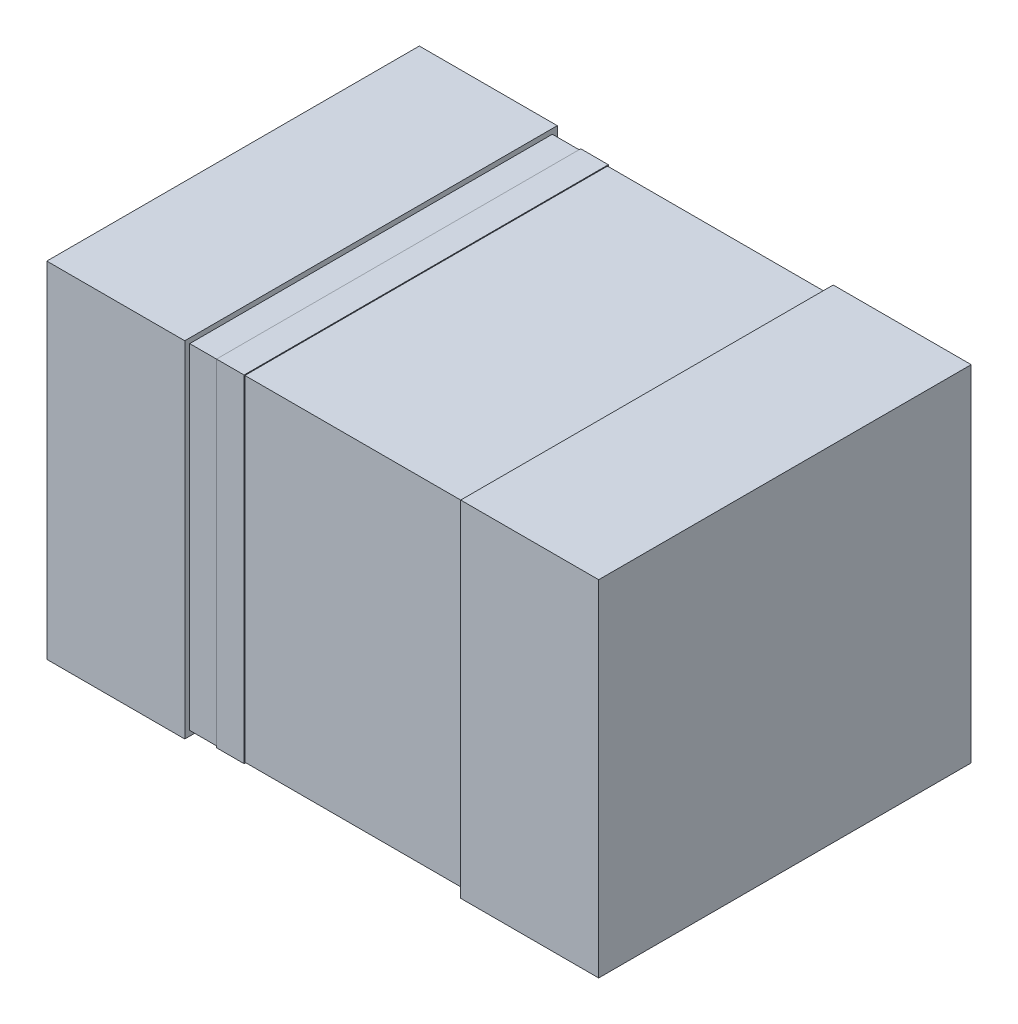
ISO-10303-21;
HEADER;
FILE_DESCRIPTION(('STEP AP214'),'2;1');
FILE_NAME('part.step','',(''),(''),'','','');
FILE_SCHEMA(('AUTOMOTIVE_DESIGN { 1 0 10303 214 1 1 1 1 }'));
ENDSEC;
DATA;
#1=APPLICATION_CONTEXT('core data for automotive mechanical design processes');
#2=APPLICATION_PROTOCOL_DEFINITION('international standard','automotive_design',2000,#1);
#3=PRODUCT_CONTEXT('',#1,'mechanical');
#4=PRODUCT('Part','Part','',(#3));
#5=PRODUCT_RELATED_PRODUCT_CATEGORY('part','',(#4));
#6=PRODUCT_DEFINITION_FORMATION('','',#4);
#7=PRODUCT_DEFINITION_CONTEXT('part definition',#1,'design');
#8=PRODUCT_DEFINITION('design','',#6,#7);
#9=PRODUCT_DEFINITION_SHAPE('','',#8);
#10=(LENGTH_UNIT() NAMED_UNIT(*) SI_UNIT(.MILLI.,.METRE.));
#11=(NAMED_UNIT(*) PLANE_ANGLE_UNIT() SI_UNIT($,.RADIAN.));
#12=(NAMED_UNIT(*) SI_UNIT($,.STERADIAN.) SOLID_ANGLE_UNIT());
#13=UNCERTAINTY_MEASURE_WITH_UNIT(LENGTH_MEASURE(1.E-05),#10,'distance_accuracy_value','');
#14=(GEOMETRIC_REPRESENTATION_CONTEXT(3) GLOBAL_UNCERTAINTY_ASSIGNED_CONTEXT((#13)) GLOBAL_UNIT_ASSIGNED_CONTEXT((#10,
#11,#12)) REPRESENTATION_CONTEXT('',''));
#15=CARTESIAN_POINT('',(0.,0.,0.));
#16=DIRECTION('',(0.,0.,1.));
#17=DIRECTION('',(1.,0.,0.));
#18=AXIS2_PLACEMENT_3D('',#15,#16,#17);
#19=CARTESIAN_POINT('',(-0.5,-0.607,0.018));
#20=DIRECTION('',(0.,-1.,0.));
#21=DIRECTION('',(0.,0.,1.));
#22=AXIS2_PLACEMENT_3D('',#19,#20,#21);
#23=PLANE('',#22);
#24=DIRECTION('',(-1.,0.,0.));
#25=VECTOR('',#24,1.);
#26=CARTESIAN_POINT('',(0.5,-0.607,0.018));
#27=LINE('',#26,#25);
#28=CARTESIAN_POINT('',(0.5,-0.607,0.018));
#29=VERTEX_POINT('',#28);
#30=CARTESIAN_POINT('',(-0.5,-0.607,0.018));
#31=VERTEX_POINT('',#30);
#32=EDGE_CURVE('P0_E11',#29,#31,#27,.T.);
#33=ORIENTED_EDGE('',*,*,#32,.F.);
#34=DIRECTION('',(0.,0.,-1.));
#35=VECTOR('',#34,1.);
#36=CARTESIAN_POINT('',(0.5,-0.607,1.332));
#37=LINE('',#36,#35);
#38=CARTESIAN_POINT('',(0.5,-0.607,1.332));
#39=VERTEX_POINT('',#38);
#40=EDGE_CURVE('P0_E24',#39,#29,#37,.T.);
#41=ORIENTED_EDGE('',*,*,#40,.F.);
#42=DIRECTION('',(1.,0.,0.));
#43=VECTOR('',#42,1.);
#44=CARTESIAN_POINT('',(-0.5,-0.607,1.332));
#45=LINE('',#44,#43);
#46=CARTESIAN_POINT('',(-0.5,-0.607,1.332));
#47=VERTEX_POINT('',#46);
#48=EDGE_CURVE('P0_E88',#47,#39,#45,.T.);
#49=ORIENTED_EDGE('',*,*,#48,.F.);
#50=DIRECTION('',(0.,0.,1.));
#51=VECTOR('',#50,1.);
#52=CARTESIAN_POINT('',(-0.5,-0.607,0.018));
#53=LINE('',#52,#51);
#54=EDGE_CURVE('P0_E77',#31,#47,#53,.T.);
#55=ORIENTED_EDGE('',*,*,#54,.F.);
#56=EDGE_LOOP('',(#33,#41,#49,#55));
#57=FACE_BOUND('',#56,.T.);
#58=ADVANCED_FACE('P0_F17',(#57),#23,.T.);
#59=CARTESIAN_POINT('',(0.5,-0.607,0.018));
#60=DIRECTION('',(1.,0.,0.));
#61=DIRECTION('',(0.,0.,1.));
#62=AXIS2_PLACEMENT_3D('',#59,#60,#61);
#63=PLANE('',#62);
#64=DIRECTION('',(0.,-1.,0.));
#65=VECTOR('',#64,1.);
#66=CARTESIAN_POINT('',(0.5,0.607,0.018));
#67=LINE('',#66,#65);
#68=CARTESIAN_POINT('',(0.5,0.607,0.018));
#69=VERTEX_POINT('',#68);
#70=EDGE_CURVE('P0_E85',#69,#29,#67,.T.);
#71=ORIENTED_EDGE('',*,*,#70,.F.);
#72=DIRECTION('',(0.,0.,-1.));
#73=VECTOR('',#72,1.);
#74=CARTESIAN_POINT('',(0.5,0.607,1.332));
#75=LINE('',#74,#73);
#76=CARTESIAN_POINT('',(0.5,0.607,1.332));
#77=VERTEX_POINT('',#76);
#78=EDGE_CURVE('P0_E83',#77,#69,#75,.T.);
#79=ORIENTED_EDGE('',*,*,#78,.F.);
#80=DIRECTION('',(0.,1.,0.));
#81=VECTOR('',#80,1.);
#82=CARTESIAN_POINT('',(0.5,-0.607,1.332));
#83=LINE('',#82,#81);
#84=EDGE_CURVE('P0_E71',#39,#77,#83,.T.);
#85=ORIENTED_EDGE('',*,*,#84,.F.);
#86=ORIENTED_EDGE('',*,*,#40,.T.);
#87=EDGE_LOOP('',(#71,#79,#85,#86));
#88=FACE_BOUND('',#87,.T.);
#89=ADVANCED_FACE('P0_F90',(#88),#63,.T.);
#90=CARTESIAN_POINT('',(0.5,0.607,0.018));
#91=DIRECTION('',(0.,1.,0.));
#92=DIRECTION('',(0.,0.,1.));
#93=AXIS2_PLACEMENT_3D('',#90,#91,#92);
#94=PLANE('',#93);
#95=DIRECTION('',(1.,0.,0.));
#96=VECTOR('',#95,1.);
#97=CARTESIAN_POINT('',(-0.5,0.607,0.018));
#98=LINE('',#97,#96);
#99=CARTESIAN_POINT('',(-0.5,0.607,0.018));
#100=VERTEX_POINT('',#99);
#101=EDGE_CURVE('P0_E60',#100,#69,#98,.T.);
#102=ORIENTED_EDGE('',*,*,#101,.F.);
#103=DIRECTION('',(0.,0.,-1.));
#104=VECTOR('',#103,1.);
#105=CARTESIAN_POINT('',(-0.5,0.607,1.332));
#106=LINE('',#105,#104);
#107=CARTESIAN_POINT('',(-0.5,0.607,1.332));
#108=VERTEX_POINT('',#107);
#109=EDGE_CURVE('P0_E54',#108,#100,#106,.T.);
#110=ORIENTED_EDGE('',*,*,#109,.F.);
#111=DIRECTION('',(-1.,0.,0.));
#112=VECTOR('',#111,1.);
#113=CARTESIAN_POINT('',(0.5,0.607,1.332));
#114=LINE('',#113,#112);
#115=EDGE_CURVE('P0_E58',#77,#108,#114,.T.);
#116=ORIENTED_EDGE('',*,*,#115,.F.);
#117=ORIENTED_EDGE('',*,*,#78,.T.);
#118=EDGE_LOOP('',(#102,#110,#116,#117));
#119=FACE_BOUND('',#118,.T.);
#120=ADVANCED_FACE('P0_F56',(#119),#94,.T.);
#121=CARTESIAN_POINT('',(-0.5,0.607,0.018));
#122=DIRECTION('',(-1.,0.,0.));
#123=DIRECTION('',(0.,0.,1.));
#124=AXIS2_PLACEMENT_3D('',#121,#122,#123);
#125=PLANE('',#124);
#126=DIRECTION('',(0.,1.,0.));
#127=VECTOR('',#126,1.);
#128=CARTESIAN_POINT('',(-0.5,-0.607,0.018));
#129=LINE('',#128,#127);
#130=EDGE_CURVE('P0_E73',#31,#100,#129,.T.);
#131=ORIENTED_EDGE('',*,*,#130,.F.);
#132=ORIENTED_EDGE('',*,*,#54,.T.);
#133=DIRECTION('',(0.,-1.,0.));
#134=VECTOR('',#133,1.);
#135=CARTESIAN_POINT('',(-0.5,0.607,1.332));
#136=LINE('',#135,#134);
#137=EDGE_CURVE('P0_E69',#108,#47,#136,.T.);
#138=ORIENTED_EDGE('',*,*,#137,.F.);
#139=ORIENTED_EDGE('',*,*,#109,.T.);
#140=EDGE_LOOP('',(#131,#132,#138,#139));
#141=FACE_BOUND('',#140,.T.);
#142=ADVANCED_FACE('P0_F76',(#141),#125,.T.);
#143=CARTESIAN_POINT('',(-0.5,0.607,0.018));
#144=DIRECTION('',(0.,0.,-1.));
#145=DIRECTION('',(0.,1.,0.));
#146=AXIS2_PLACEMENT_3D('',#143,#144,#145);
#147=PLANE('',#146);
#148=ORIENTED_EDGE('',*,*,#101,.T.);
#149=ORIENTED_EDGE('',*,*,#70,.T.);
#150=ORIENTED_EDGE('',*,*,#32,.T.);
#151=ORIENTED_EDGE('',*,*,#130,.T.);
#152=EDGE_LOOP('',(#148,#149,#150,#151));
#153=FACE_BOUND('',#152,.T.);
#154=ADVANCED_FACE('P0_F91',(#153),#147,.T.);
#155=CARTESIAN_POINT('',(-0.5,-0.607,1.332));
#156=DIRECTION('',(0.,0.,1.));
#157=DIRECTION('',(0.,1.,0.));
#158=AXIS2_PLACEMENT_3D('',#155,#156,#157);
#159=PLANE('',#158);
#160=ORIENTED_EDGE('',*,*,#48,.T.);
#161=ORIENTED_EDGE('',*,*,#84,.T.);
#162=ORIENTED_EDGE('',*,*,#115,.T.);
#163=ORIENTED_EDGE('',*,*,#137,.T.);
#164=EDGE_LOOP('',(#160,#161,#162,#163));
#165=FACE_BOUND('',#164,.T.);
#166=ADVANCED_FACE('P0_F68',(#165),#159,.T.);
#167=CLOSED_SHELL('',(#58,#89,#120,#142,#154,#166));
#168=MANIFOLD_SOLID_BREP('P0_B1',#167);
#169=CARTESIAN_POINT('',(0.5,-0.625,0.));
#170=DIRECTION('',(0.,-1.,0.));
#171=DIRECTION('',(0.,0.,1.));
#172=AXIS2_PLACEMENT_3D('',#169,#170,#171);
#173=PLANE('',#172);
#174=DIRECTION('',(-1.,0.,0.));
#175=VECTOR('',#174,1.);
#176=CARTESIAN_POINT('',(1.,-0.625,0.));
#177=LINE('',#176,#175);
#178=CARTESIAN_POINT('',(1.,-0.625,0.));
#179=VERTEX_POINT('',#178);
#180=CARTESIAN_POINT('',(0.5,-0.625,0.));
#181=VERTEX_POINT('',#180);
#182=EDGE_CURVE('P1_E11',#179,#181,#177,.T.);
#183=ORIENTED_EDGE('',*,*,#182,.F.);
#184=DIRECTION('',(0.,0.,-1.));
#185=VECTOR('',#184,1.);
#186=CARTESIAN_POINT('',(1.,-0.625,1.35));
#187=LINE('',#186,#185);
#188=CARTESIAN_POINT('',(1.,-0.625,1.35));
#189=VERTEX_POINT('',#188);
#190=EDGE_CURVE('P1_E24',#189,#179,#187,.T.);
#191=ORIENTED_EDGE('',*,*,#190,.F.);
#192=DIRECTION('',(1.,0.,0.));
#193=VECTOR('',#192,1.);
#194=CARTESIAN_POINT('',(0.5,-0.625,1.35));
#195=LINE('',#194,#193);
#196=CARTESIAN_POINT('',(0.5,-0.625,1.35));
#197=VERTEX_POINT('',#196);
#198=EDGE_CURVE('P1_E87',#197,#189,#195,.T.);
#199=ORIENTED_EDGE('',*,*,#198,.F.);
#200=DIRECTION('',(0.,0.,1.));
#201=VECTOR('',#200,1.);
#202=CARTESIAN_POINT('',(0.5,-0.625,0.));
#203=LINE('',#202,#201);
#204=EDGE_CURVE('P1_E75',#181,#197,#203,.T.);
#205=ORIENTED_EDGE('',*,*,#204,.F.);
#206=EDGE_LOOP('',(#183,#191,#199,#205));
#207=FACE_BOUND('',#206,.T.);
#208=ADVANCED_FACE('P1_F17',(#207),#173,.T.);
#209=CARTESIAN_POINT('',(1.,-0.625,0.));
#210=DIRECTION('',(1.,0.,0.));
#211=DIRECTION('',(0.,0.,1.));
#212=AXIS2_PLACEMENT_3D('',#209,#210,#211);
#213=PLANE('',#212);
#214=DIRECTION('',(0.,-1.,0.));
#215=VECTOR('',#214,1.);
#216=CARTESIAN_POINT('',(1.,0.625,0.));
#217=LINE('',#216,#215);
#218=CARTESIAN_POINT('',(1.,0.625,0.));
#219=VERTEX_POINT('',#218);
#220=EDGE_CURVE('P1_E84',#219,#179,#217,.T.);
#221=ORIENTED_EDGE('',*,*,#220,.F.);
#222=DIRECTION('',(0.,0.,-1.));
#223=VECTOR('',#222,1.);
#224=CARTESIAN_POINT('',(1.,0.625,1.35));
#225=LINE('',#224,#223);
#226=CARTESIAN_POINT('',(1.,0.625,1.35));
#227=VERTEX_POINT('',#226);
#228=EDGE_CURVE('P1_E82',#227,#219,#225,.T.);
#229=ORIENTED_EDGE('',*,*,#228,.F.);
#230=DIRECTION('',(0.,1.,0.));
#231=VECTOR('',#230,1.);
#232=CARTESIAN_POINT('',(1.,-0.625,1.35));
#233=LINE('',#232,#231);
#234=EDGE_CURVE('P1_E60',#189,#227,#233,.T.);
#235=ORIENTED_EDGE('',*,*,#234,.F.);
#236=ORIENTED_EDGE('',*,*,#190,.T.);
#237=EDGE_LOOP('',(#221,#229,#235,#236));
#238=FACE_BOUND('',#237,.T.);
#239=ADVANCED_FACE('P1_F90',(#238),#213,.T.);
#240=CARTESIAN_POINT('',(1.,0.625,0.));
#241=DIRECTION('',(0.,1.,0.));
#242=DIRECTION('',(0.,0.,1.));
#243=AXIS2_PLACEMENT_3D('',#240,#241,#242);
#244=PLANE('',#243);
#245=DIRECTION('',(1.,0.,0.));
#246=VECTOR('',#245,1.);
#247=CARTESIAN_POINT('',(0.5,0.625,0.));
#248=LINE('',#247,#246);
#249=CARTESIAN_POINT('',(0.5,0.625,0.));
#250=VERTEX_POINT('',#249);
#251=EDGE_CURVE('P1_E70',#250,#219,#248,.T.);
#252=ORIENTED_EDGE('',*,*,#251,.F.);
#253=DIRECTION('',(0.,0.,-1.));
#254=VECTOR('',#253,1.);
#255=CARTESIAN_POINT('',(0.5,0.625,1.35));
#256=LINE('',#255,#254);
#257=CARTESIAN_POINT('',(0.5,0.625,1.35));
#258=VERTEX_POINT('',#257);
#259=EDGE_CURVE('P1_E64',#258,#250,#256,.T.);
#260=ORIENTED_EDGE('',*,*,#259,.F.);
#261=DIRECTION('',(-1.,0.,0.));
#262=VECTOR('',#261,1.);
#263=CARTESIAN_POINT('',(1.,0.625,1.35));
#264=LINE('',#263,#262);
#265=EDGE_CURVE('P1_E54',#227,#258,#264,.T.);
#266=ORIENTED_EDGE('',*,*,#265,.F.);
#267=ORIENTED_EDGE('',*,*,#228,.T.);
#268=EDGE_LOOP('',(#252,#260,#266,#267));
#269=FACE_BOUND('',#268,.T.);
#270=ADVANCED_FACE('P1_F68',(#269),#244,.T.);
#271=CARTESIAN_POINT('',(0.5,0.625,0.));
#272=DIRECTION('',(-1.,0.,0.));
#273=DIRECTION('',(0.,0.,1.));
#274=AXIS2_PLACEMENT_3D('',#271,#272,#273);
#275=PLANE('',#274);
#276=DIRECTION('',(0.,1.,0.));
#277=VECTOR('',#276,1.);
#278=CARTESIAN_POINT('',(0.5,-0.625,0.));
#279=LINE('',#278,#277);
#280=EDGE_CURVE('P1_E65',#181,#250,#279,.T.);
#281=ORIENTED_EDGE('',*,*,#280,.F.);
#282=ORIENTED_EDGE('',*,*,#204,.T.);
#283=DIRECTION('',(0.,-1.,0.));
#284=VECTOR('',#283,1.);
#285=CARTESIAN_POINT('',(0.5,0.625,1.35));
#286=LINE('',#285,#284);
#287=EDGE_CURVE('P1_E59',#258,#197,#286,.T.);
#288=ORIENTED_EDGE('',*,*,#287,.F.);
#289=ORIENTED_EDGE('',*,*,#259,.T.);
#290=EDGE_LOOP('',(#281,#282,#288,#289));
#291=FACE_BOUND('',#290,.T.);
#292=ADVANCED_FACE('P1_F74',(#291),#275,.T.);
#293=CARTESIAN_POINT('',(0.5,0.625,0.));
#294=DIRECTION('',(0.,0.,-1.));
#295=DIRECTION('',(0.,1.,0.));
#296=AXIS2_PLACEMENT_3D('',#293,#294,#295);
#297=PLANE('',#296);
#298=ORIENTED_EDGE('',*,*,#251,.T.);
#299=ORIENTED_EDGE('',*,*,#220,.T.);
#300=ORIENTED_EDGE('',*,*,#182,.T.);
#301=ORIENTED_EDGE('',*,*,#280,.T.);
#302=EDGE_LOOP('',(#298,#299,#300,#301));
#303=FACE_BOUND('',#302,.T.);
#304=ADVANCED_FACE('P1_F91',(#303),#297,.T.);
#305=CARTESIAN_POINT('',(0.5,-0.625,1.35));
#306=DIRECTION('',(0.,0.,1.));
#307=DIRECTION('',(0.,1.,0.));
#308=AXIS2_PLACEMENT_3D('',#305,#306,#307);
#309=PLANE('',#308);
#310=ORIENTED_EDGE('',*,*,#198,.T.);
#311=ORIENTED_EDGE('',*,*,#234,.T.);
#312=ORIENTED_EDGE('',*,*,#265,.T.);
#313=ORIENTED_EDGE('',*,*,#287,.T.);
#314=EDGE_LOOP('',(#310,#311,#312,#313));
#315=FACE_BOUND('',#314,.T.);
#316=ADVANCED_FACE('P1_F57',(#315),#309,.T.);
#317=CLOSED_SHELL('',(#208,#239,#270,#292,#304,#316));
#318=MANIFOLD_SOLID_BREP('P1_B1',#317);
#319=CARTESIAN_POINT('',(-1.,-0.625,0.));
#320=DIRECTION('',(0.,-1.,0.));
#321=DIRECTION('',(0.,0.,1.));
#322=AXIS2_PLACEMENT_3D('',#319,#320,#321);
#323=PLANE('',#322);
#324=DIRECTION('',(-1.,0.,0.));
#325=VECTOR('',#324,1.);
#326=CARTESIAN_POINT('',(-0.5,-0.625,0.));
#327=LINE('',#326,#325);
#328=CARTESIAN_POINT('',(-0.5,-0.625,0.));
#329=VERTEX_POINT('',#328);
#330=CARTESIAN_POINT('',(-1.,-0.625,0.));
#331=VERTEX_POINT('',#330);
#332=EDGE_CURVE('P2_E11',#329,#331,#327,.T.);
#333=ORIENTED_EDGE('',*,*,#332,.F.);
#334=DIRECTION('',(0.,0.,-1.));
#335=VECTOR('',#334,1.);
#336=CARTESIAN_POINT('',(-0.5,-0.625,1.35));
#337=LINE('',#336,#335);
#338=CARTESIAN_POINT('',(-0.5,-0.625,1.35));
#339=VERTEX_POINT('',#338);
#340=EDGE_CURVE('P2_E24',#339,#329,#337,.T.);
#341=ORIENTED_EDGE('',*,*,#340,.F.);
#342=DIRECTION('',(1.,0.,0.));
#343=VECTOR('',#342,1.);
#344=CARTESIAN_POINT('',(-1.,-0.625,1.35));
#345=LINE('',#344,#343);
#346=CARTESIAN_POINT('',(-1.,-0.625,1.35));
#347=VERTEX_POINT('',#346);
#348=EDGE_CURVE('P2_E88',#347,#339,#345,.T.);
#349=ORIENTED_EDGE('',*,*,#348,.F.);
#350=DIRECTION('',(0.,0.,1.));
#351=VECTOR('',#350,1.);
#352=CARTESIAN_POINT('',(-1.,-0.625,0.));
#353=LINE('',#352,#351);
#354=EDGE_CURVE('P2_E71',#331,#347,#353,.T.);
#355=ORIENTED_EDGE('',*,*,#354,.F.);
#356=EDGE_LOOP('',(#333,#341,#349,#355));
#357=FACE_BOUND('',#356,.T.);
#358=ADVANCED_FACE('P2_F17',(#357),#323,.T.);
#359=CARTESIAN_POINT('',(-0.5,-0.625,0.));
#360=DIRECTION('',(1.,0.,0.));
#361=DIRECTION('',(0.,0.,1.));
#362=AXIS2_PLACEMENT_3D('',#359,#360,#361);
#363=PLANE('',#362);
#364=DIRECTION('',(0.,-1.,0.));
#365=VECTOR('',#364,1.);
#366=CARTESIAN_POINT('',(-0.5,0.625,0.));
#367=LINE('',#366,#365);
#368=CARTESIAN_POINT('',(-0.5,0.625,0.));
#369=VERTEX_POINT('',#368);
#370=EDGE_CURVE('P2_E85',#369,#329,#367,.T.);
#371=ORIENTED_EDGE('',*,*,#370,.F.);
#372=DIRECTION('',(0.,0.,-1.));
#373=VECTOR('',#372,1.);
#374=CARTESIAN_POINT('',(-0.5,0.625,1.35));
#375=LINE('',#374,#373);
#376=CARTESIAN_POINT('',(-0.5,0.625,1.35));
#377=VERTEX_POINT('',#376);
#378=EDGE_CURVE('P2_E83',#377,#369,#375,.T.);
#379=ORIENTED_EDGE('',*,*,#378,.F.);
#380=DIRECTION('',(0.,1.,0.));
#381=VECTOR('',#380,1.);
#382=CARTESIAN_POINT('',(-0.5,-0.625,1.35));
#383=LINE('',#382,#381);
#384=EDGE_CURVE('P2_E59',#339,#377,#383,.T.);
#385=ORIENTED_EDGE('',*,*,#384,.F.);
#386=ORIENTED_EDGE('',*,*,#340,.T.);
#387=EDGE_LOOP('',(#371,#379,#385,#386));
#388=FACE_BOUND('',#387,.T.);
#389=ADVANCED_FACE('P2_F90',(#388),#363,.T.);
#390=CARTESIAN_POINT('',(-0.5,0.625,0.));
#391=DIRECTION('',(0.,1.,0.));
#392=DIRECTION('',(0.,0.,1.));
#393=AXIS2_PLACEMENT_3D('',#390,#391,#392);
#394=PLANE('',#393);
#395=DIRECTION('',(1.,0.,0.));
#396=VECTOR('',#395,1.);
#397=CARTESIAN_POINT('',(-1.,0.625,0.));
#398=LINE('',#397,#396);
#399=CARTESIAN_POINT('',(-1.,0.625,0.));
#400=VERTEX_POINT('',#399);
#401=EDGE_CURVE('P2_E77',#400,#369,#398,.T.);
#402=ORIENTED_EDGE('',*,*,#401,.F.);
#403=DIRECTION('',(0.,0.,-1.));
#404=VECTOR('',#403,1.);
#405=CARTESIAN_POINT('',(-1.,0.625,1.35));
#406=LINE('',#405,#404);
#407=CARTESIAN_POINT('',(-1.,0.625,1.35));
#408=VERTEX_POINT('',#407);
#409=EDGE_CURVE('P2_E64',#408,#400,#406,.T.);
#410=ORIENTED_EDGE('',*,*,#409,.F.);
#411=DIRECTION('',(-1.,0.,0.));
#412=VECTOR('',#411,1.);
#413=CARTESIAN_POINT('',(-0.5,0.625,1.35));
#414=LINE('',#413,#412);
#415=EDGE_CURVE('P2_E54',#377,#408,#414,.T.);
#416=ORIENTED_EDGE('',*,*,#415,.F.);
#417=ORIENTED_EDGE('',*,*,#378,.T.);
#418=EDGE_LOOP('',(#402,#410,#416,#417));
#419=FACE_BOUND('',#418,.T.);
#420=ADVANCED_FACE('P2_F75',(#419),#394,.T.);
#421=CARTESIAN_POINT('',(-1.,0.625,0.));
#422=DIRECTION('',(-1.,0.,0.));
#423=DIRECTION('',(0.,0.,1.));
#424=AXIS2_PLACEMENT_3D('',#421,#422,#423);
#425=PLANE('',#424);
#426=DIRECTION('',(0.,1.,0.));
#427=VECTOR('',#426,1.);
#428=CARTESIAN_POINT('',(-1.,-0.625,0.));
#429=LINE('',#428,#427);
#430=EDGE_CURVE('P2_E65',#331,#400,#429,.T.);
#431=ORIENTED_EDGE('',*,*,#430,.F.);
#432=ORIENTED_EDGE('',*,*,#354,.T.);
#433=DIRECTION('',(0.,-1.,0.));
#434=VECTOR('',#433,1.);
#435=CARTESIAN_POINT('',(-1.,0.625,1.35));
#436=LINE('',#435,#434);
#437=EDGE_CURVE('P2_E58',#408,#347,#436,.T.);
#438=ORIENTED_EDGE('',*,*,#437,.F.);
#439=ORIENTED_EDGE('',*,*,#409,.T.);
#440=EDGE_LOOP('',(#431,#432,#438,#439));
#441=FACE_BOUND('',#440,.T.);
#442=ADVANCED_FACE('P2_F70',(#441),#425,.T.);
#443=CARTESIAN_POINT('',(-1.,0.625,0.));
#444=DIRECTION('',(0.,0.,-1.));
#445=DIRECTION('',(0.,1.,0.));
#446=AXIS2_PLACEMENT_3D('',#443,#444,#445);
#447=PLANE('',#446);
#448=ORIENTED_EDGE('',*,*,#401,.T.);
#449=ORIENTED_EDGE('',*,*,#370,.T.);
#450=ORIENTED_EDGE('',*,*,#332,.T.);
#451=ORIENTED_EDGE('',*,*,#430,.T.);
#452=EDGE_LOOP('',(#448,#449,#450,#451));
#453=FACE_BOUND('',#452,.T.);
#454=ADVANCED_FACE('P2_F91',(#453),#447,.T.);
#455=CARTESIAN_POINT('',(-1.,-0.625,1.35));
#456=DIRECTION('',(0.,0.,1.));
#457=DIRECTION('',(0.,1.,0.));
#458=AXIS2_PLACEMENT_3D('',#455,#456,#457);
#459=PLANE('',#458);
#460=ORIENTED_EDGE('',*,*,#348,.T.);
#461=ORIENTED_EDGE('',*,*,#384,.T.);
#462=ORIENTED_EDGE('',*,*,#415,.T.);
#463=ORIENTED_EDGE('',*,*,#437,.T.);
#464=EDGE_LOOP('',(#460,#461,#462,#463));
#465=FACE_BOUND('',#464,.T.);
#466=ADVANCED_FACE('P2_F57',(#465),#459,.T.);
#467=CLOSED_SHELL('',(#358,#389,#420,#442,#454,#466));
#468=MANIFOLD_SOLID_BREP('P2_B1',#467);
#469=CARTESIAN_POINT('',(-0.4,0.61,0.015));
#470=DIRECTION('',(0.,0.,-1.));
#471=DIRECTION('',(0.,1.,0.));
#472=AXIS2_PLACEMENT_3D('',#469,#470,#471);
#473=PLANE('',#472);
#474=DIRECTION('',(-1.,0.,0.));
#475=VECTOR('',#474,1.);
#476=CARTESIAN_POINT('',(-0.3,0.61,0.015));
#477=LINE('',#476,#475);
#478=CARTESIAN_POINT('',(-0.3,0.61,0.015));
#479=VERTEX_POINT('',#478);
#480=CARTESIAN_POINT('',(-0.4,0.61,0.015));
#481=VERTEX_POINT('',#480);
#482=EDGE_CURVE('P3_E10',#479,#481,#477,.T.);
#483=ORIENTED_EDGE('',*,*,#482,.F.);
#484=DIRECTION('',(0.,1.,0.));
#485=VECTOR('',#484,1.);
#486=CARTESIAN_POINT('',(-0.3,-0.61,0.015));
#487=LINE('',#486,#485);
#488=CARTESIAN_POINT('',(-0.3,-0.61,0.015));
#489=VERTEX_POINT('',#488);
#490=EDGE_CURVE('P3_E23',#489,#479,#487,.T.);
#491=ORIENTED_EDGE('',*,*,#490,.F.);
#492=DIRECTION('',(1.,0.,0.));
#493=VECTOR('',#492,1.);
#494=CARTESIAN_POINT('',(-0.4,-0.61,0.015));
#495=LINE('',#494,#493);
#496=CARTESIAN_POINT('',(-0.4,-0.61,0.015));
#497=VERTEX_POINT('',#496);
#498=EDGE_CURVE('P3_E154',#497,#489,#495,.T.);
#499=ORIENTED_EDGE('',*,*,#498,.F.);
#500=DIRECTION('',(0.,-1.,0.));
#501=VECTOR('',#500,1.);
#502=CARTESIAN_POINT('',(-0.4,0.61,0.015));
#503=LINE('',#502,#501);
#504=EDGE_CURVE('P3_E152',#481,#497,#503,.T.);
#505=ORIENTED_EDGE('',*,*,#504,.F.);
#506=EDGE_LOOP('',(#483,#491,#499,#505));
#507=FACE_BOUND('',#506,.T.);
#508=ADVANCED_FACE('P3_F16',(#507),#473,.T.);
#509=CARTESIAN_POINT('',(-0.4,-0.61,0.015));
#510=DIRECTION('',(0.,-1.,0.));
#511=DIRECTION('',(0.,0.,1.));
#512=AXIS2_PLACEMENT_3D('',#509,#510,#511);
#513=PLANE('',#512);
#514=ORIENTED_EDGE('',*,*,#498,.T.);
#515=DIRECTION('',(0.,0.,-1.));
#516=VECTOR('',#515,1.);
#517=CARTESIAN_POINT('',(-0.3,-0.61,1.335));
#518=LINE('',#517,#516);
#519=CARTESIAN_POINT('',(-0.3,-0.61,1.335));
#520=VERTEX_POINT('',#519);
#521=EDGE_CURVE('P3_E149',#520,#489,#518,.T.);
#522=ORIENTED_EDGE('',*,*,#521,.F.);
#523=DIRECTION('',(1.,0.,0.));
#524=VECTOR('',#523,1.);
#525=CARTESIAN_POINT('',(-0.4,-0.61,1.335));
#526=LINE('',#525,#524);
#527=CARTESIAN_POINT('',(-0.4,-0.61,1.335));
#528=VERTEX_POINT('',#527);
#529=EDGE_CURVE('P3_E146',#528,#520,#526,.T.);
#530=ORIENTED_EDGE('',*,*,#529,.F.);
#531=DIRECTION('',(0.,0.,1.));
#532=VECTOR('',#531,1.);
#533=CARTESIAN_POINT('',(-0.4,-0.61,0.015));
#534=LINE('',#533,#532);
#535=EDGE_CURVE('P3_E143',#497,#528,#534,.T.);
#536=ORIENTED_EDGE('',*,*,#535,.F.);
#537=EDGE_LOOP('',(#514,#522,#530,#536));
#538=FACE_BOUND('',#537,.T.);
#539=ADVANCED_FACE('P3_F181',(#538),#513,.T.);
#540=CARTESIAN_POINT('',(-0.3,0.61,0.015));
#541=DIRECTION('',(0.,1.,0.));
#542=DIRECTION('',(0.,0.,1.));
#543=AXIS2_PLACEMENT_3D('',#540,#541,#542);
#544=PLANE('',#543);
#545=ORIENTED_EDGE('',*,*,#482,.T.);
#546=DIRECTION('',(0.,0.,-1.));
#547=VECTOR('',#546,1.);
#548=CARTESIAN_POINT('',(-0.4,0.61,1.335));
#549=LINE('',#548,#547);
#550=CARTESIAN_POINT('',(-0.4,0.61,1.335));
#551=VERTEX_POINT('',#550);
#552=EDGE_CURVE('P3_E141',#551,#481,#549,.T.);
#553=ORIENTED_EDGE('',*,*,#552,.F.);
#554=DIRECTION('',(-1.,0.,0.));
#555=VECTOR('',#554,1.);
#556=CARTESIAN_POINT('',(-0.3,0.61,1.335));
#557=LINE('',#556,#555);
#558=CARTESIAN_POINT('',(-0.3,0.61,1.335));
#559=VERTEX_POINT('',#558);
#560=EDGE_CURVE('P3_E138',#559,#551,#557,.T.);
#561=ORIENTED_EDGE('',*,*,#560,.F.);
#562=DIRECTION('',(0.,0.,1.));
#563=VECTOR('',#562,1.);
#564=CARTESIAN_POINT('',(-0.3,0.61,0.015));
#565=LINE('',#564,#563);
#566=EDGE_CURVE('P3_E135',#479,#559,#565,.T.);
#567=ORIENTED_EDGE('',*,*,#566,.F.);
#568=EDGE_LOOP('',(#545,#553,#561,#567));
#569=FACE_BOUND('',#568,.T.);
#570=ADVANCED_FACE('P3_F162',(#569),#544,.T.);
#571=CARTESIAN_POINT('',(-0.4,-0.61,1.335));
#572=DIRECTION('',(0.,0.,1.));
#573=DIRECTION('',(0.,1.,0.));
#574=AXIS2_PLACEMENT_3D('',#571,#572,#573);
#575=PLANE('',#574);
#576=ORIENTED_EDGE('',*,*,#529,.T.);
#577=DIRECTION('',(0.,-1.,0.));
#578=VECTOR('',#577,1.);
#579=CARTESIAN_POINT('',(-0.3,0.61,1.335));
#580=LINE('',#579,#578);
#581=EDGE_CURVE('P3_E133',#559,#520,#580,.T.);
#582=ORIENTED_EDGE('',*,*,#581,.F.);
#583=ORIENTED_EDGE('',*,*,#560,.T.);
#584=DIRECTION('',(0.,1.,0.));
#585=VECTOR('',#584,1.);
#586=CARTESIAN_POINT('',(-0.4,-0.61,1.335));
#587=LINE('',#586,#585);
#588=EDGE_CURVE('P3_E131',#528,#551,#587,.T.);
#589=ORIENTED_EDGE('',*,*,#588,.F.);
#590=EDGE_LOOP('',(#576,#582,#583,#589));
#591=FACE_BOUND('',#590,.T.);
#592=ADVANCED_FACE('P3_F179',(#591),#575,.T.);
#593=CARTESIAN_POINT('',(-0.3,-0.61,0.015));
#594=DIRECTION('',(1.,0.,0.));
#595=DIRECTION('',(0.,0.,1.));
#596=AXIS2_PLACEMENT_3D('',#593,#594,#595);
#597=PLANE('',#596);
#598=ORIENTED_EDGE('',*,*,#490,.T.);
#599=ORIENTED_EDGE('',*,*,#566,.T.);
#600=DIRECTION('',(0.,0.707106781186548,0.707106781186548));
#601=VECTOR('',#600,1.);
#602=CARTESIAN_POINT('',(-0.3,0.607,1.332));
#603=LINE('',#602,#601);
#604=CARTESIAN_POINT('',(-0.3,0.607,1.332));
#605=VERTEX_POINT('',#604);
#606=EDGE_CURVE('P3_E128',#605,#559,#603,.T.);
#607=ORIENTED_EDGE('',*,*,#606,.F.);
#608=DIRECTION('',(0.,0.,1.));
#609=VECTOR('',#608,1.);
#610=CARTESIAN_POINT('',(-0.3,0.607,0.018));
#611=LINE('',#610,#609);
#612=CARTESIAN_POINT('',(-0.3,0.607,0.018));
#613=VERTEX_POINT('',#612);
#614=EDGE_CURVE('P3_E125',#613,#605,#611,.T.);
#615=ORIENTED_EDGE('',*,*,#614,.F.);
#616=DIRECTION('',(0.,1.,0.));
#617=VECTOR('',#616,1.);
#618=CARTESIAN_POINT('',(-0.3,-0.607,0.018));
#619=LINE('',#618,#617);
#620=CARTESIAN_POINT('',(-0.3,-0.607,0.018));
#621=VERTEX_POINT('',#620);
#622=EDGE_CURVE('P3_E123',#621,#613,#619,.T.);
#623=ORIENTED_EDGE('',*,*,#622,.F.);
#624=DIRECTION('',(0.,0.707106781186548,0.707106781186548));
#625=VECTOR('',#624,1.);
#626=CARTESIAN_POINT('',(-0.3,-0.61,0.015));
#627=LINE('',#626,#625);
#628=EDGE_CURVE('P3_E120',#489,#621,#627,.T.);
#629=ORIENTED_EDGE('',*,*,#628,.F.);
#630=EDGE_LOOP('',(#598,#599,#607,#615,#623,#629));
#631=FACE_BOUND('',#630,.T.);
#632=ADVANCED_FACE('P3_F158',(#631),#597,.T.);
#633=CARTESIAN_POINT('',(-0.3,-0.61,0.015));
#634=DIRECTION('',(1.,0.,0.));
#635=DIRECTION('',(0.,0.,1.));
#636=AXIS2_PLACEMENT_3D('',#633,#634,#635);
#637=PLANE('',#636);
#638=ORIENTED_EDGE('',*,*,#628,.T.);
#639=DIRECTION('',(0.,0.,-1.));
#640=VECTOR('',#639,1.);
#641=CARTESIAN_POINT('',(-0.3,-0.607,1.332));
#642=LINE('',#641,#640);
#643=CARTESIAN_POINT('',(-0.3,-0.607,1.332));
#644=VERTEX_POINT('',#643);
#645=EDGE_CURVE('P3_E118',#644,#621,#642,.T.);
#646=ORIENTED_EDGE('',*,*,#645,.F.);
#647=DIRECTION('',(0.,-1.,0.));
#648=VECTOR('',#647,1.);
#649=CARTESIAN_POINT('',(-0.3,0.607,1.332));
#650=LINE('',#649,#648);
#651=EDGE_CURVE('P3_E83',#605,#644,#650,.T.);
#652=ORIENTED_EDGE('',*,*,#651,.F.);
#653=ORIENTED_EDGE('',*,*,#606,.T.);
#654=ORIENTED_EDGE('',*,*,#581,.T.);
#655=ORIENTED_EDGE('',*,*,#521,.T.);
#656=EDGE_LOOP('',(#638,#646,#652,#653,#654,#655));
#657=FACE_BOUND('',#656,.T.);
#658=ADVANCED_FACE('P3_F166',(#657),#637,.T.);
#659=CARTESIAN_POINT('',(-0.4,0.61,0.015));
#660=DIRECTION('',(-1.,0.,0.));
#661=DIRECTION('',(0.,0.,1.));
#662=AXIS2_PLACEMENT_3D('',#659,#660,#661);
#663=PLANE('',#662);
#664=ORIENTED_EDGE('',*,*,#504,.T.);
#665=DIRECTION('',(0.,-0.707106781186548,-0.707106781186548));
#666=VECTOR('',#665,1.);
#667=CARTESIAN_POINT('',(-0.4,-0.607,0.018));
#668=LINE('',#667,#666);
#669=CARTESIAN_POINT('',(-0.4,-0.607,0.018));
#670=VERTEX_POINT('',#669);
#671=EDGE_CURVE('P3_E115',#670,#497,#668,.T.);
#672=ORIENTED_EDGE('',*,*,#671,.F.);
#673=DIRECTION('',(0.,-1.,0.));
#674=VECTOR('',#673,1.);
#675=CARTESIAN_POINT('',(-0.4,0.607,0.018));
#676=LINE('',#675,#674);
#677=CARTESIAN_POINT('',(-0.4,0.607,0.018));
#678=VERTEX_POINT('',#677);
#679=EDGE_CURVE('P3_E113',#678,#670,#676,.T.);
#680=ORIENTED_EDGE('',*,*,#679,.F.);
#681=DIRECTION('',(0.,0.,-1.));
#682=VECTOR('',#681,1.);
#683=CARTESIAN_POINT('',(-0.4,0.607,1.332));
#684=LINE('',#683,#682);
#685=CARTESIAN_POINT('',(-0.4,0.607,1.332));
#686=VERTEX_POINT('',#685);
#687=EDGE_CURVE('P3_E110',#686,#678,#684,.T.);
#688=ORIENTED_EDGE('',*,*,#687,.F.);
#689=DIRECTION('',(0.,-0.707106781186548,-0.707106781186548));
#690=VECTOR('',#689,1.);
#691=CARTESIAN_POINT('',(-0.4,0.61,1.335));
#692=LINE('',#691,#690);
#693=EDGE_CURVE('P3_E98',#551,#686,#692,.T.);
#694=ORIENTED_EDGE('',*,*,#693,.F.);
#695=ORIENTED_EDGE('',*,*,#552,.T.);
#696=EDGE_LOOP('',(#664,#672,#680,#688,#694,#695));
#697=FACE_BOUND('',#696,.T.);
#698=ADVANCED_FACE('P3_F176',(#697),#663,.T.);
#699=CARTESIAN_POINT('',(-0.4,-0.607,0.018));
#700=DIRECTION('',(-1.,0.,0.));
#701=DIRECTION('',(0.,0.,1.));
#702=AXIS2_PLACEMENT_3D('',#699,#700,#701);
#703=PLANE('',#702);
#704=ORIENTED_EDGE('',*,*,#671,.T.);
#705=ORIENTED_EDGE('',*,*,#535,.T.);
#706=ORIENTED_EDGE('',*,*,#588,.T.);
#707=ORIENTED_EDGE('',*,*,#693,.T.);
#708=DIRECTION('',(0.,1.,0.));
#709=VECTOR('',#708,1.);
#710=CARTESIAN_POINT('',(-0.4,-0.607,1.332));
#711=LINE('',#710,#709);
#712=CARTESIAN_POINT('',(-0.4,-0.607,1.332));
#713=VERTEX_POINT('',#712);
#714=EDGE_CURVE('P3_E81',#713,#686,#711,.T.);
#715=ORIENTED_EDGE('',*,*,#714,.F.);
#716=DIRECTION('',(0.,0.,1.));
#717=VECTOR('',#716,1.);
#718=CARTESIAN_POINT('',(-0.4,-0.607,0.018));
#719=LINE('',#718,#717);
#720=EDGE_CURVE('P3_E94',#670,#713,#719,.T.);
#721=ORIENTED_EDGE('',*,*,#720,.F.);
#722=EDGE_LOOP('',(#704,#705,#706,#707,#715,#721));
#723=FACE_BOUND('',#722,.T.);
#724=ADVANCED_FACE('P3_F93',(#723),#703,.T.);
#725=CARTESIAN_POINT('',(-0.4,0.607,0.018));
#726=DIRECTION('',(0.,-1.,0.));
#727=DIRECTION('',(0.,0.,1.));
#728=AXIS2_PLACEMENT_3D('',#725,#726,#727);
#729=PLANE('',#728);
#730=DIRECTION('',(-1.,0.,0.));
#731=VECTOR('',#730,1.);
#732=CARTESIAN_POINT('',(-0.3,0.607,0.018));
#733=LINE('',#732,#731);
#734=EDGE_CURVE('P3_E103',#613,#678,#733,.T.);
#735=ORIENTED_EDGE('',*,*,#734,.F.);
#736=ORIENTED_EDGE('',*,*,#614,.T.);
#737=DIRECTION('',(1.,0.,0.));
#738=VECTOR('',#737,1.);
#739=CARTESIAN_POINT('',(-0.4,0.607,1.332));
#740=LINE('',#739,#738);
#741=EDGE_CURVE('P3_E105',#686,#605,#740,.T.);
#742=ORIENTED_EDGE('',*,*,#741,.F.);
#743=ORIENTED_EDGE('',*,*,#687,.T.);
#744=EDGE_LOOP('',(#735,#736,#742,#743));
#745=FACE_BOUND('',#744,.T.);
#746=ADVANCED_FACE('P3_F171',(#745),#729,.T.);
#747=CARTESIAN_POINT('',(-0.3,-0.607,0.018));
#748=DIRECTION('',(0.,1.,0.));
#749=DIRECTION('',(0.,0.,1.));
#750=AXIS2_PLACEMENT_3D('',#747,#748,#749);
#751=PLANE('',#750);
#752=DIRECTION('',(1.,0.,0.));
#753=VECTOR('',#752,1.);
#754=CARTESIAN_POINT('',(-0.4,-0.607,0.018));
#755=LINE('',#754,#753);
#756=EDGE_CURVE('P3_E88',#670,#621,#755,.T.);
#757=ORIENTED_EDGE('',*,*,#756,.F.);
#758=ORIENTED_EDGE('',*,*,#720,.T.);
#759=DIRECTION('',(-1.,0.,0.));
#760=VECTOR('',#759,1.);
#761=CARTESIAN_POINT('',(-0.3,-0.607,1.332));
#762=LINE('',#761,#760);
#763=EDGE_CURVE('P3_E77',#644,#713,#762,.T.);
#764=ORIENTED_EDGE('',*,*,#763,.F.);
#765=ORIENTED_EDGE('',*,*,#645,.T.);
#766=EDGE_LOOP('',(#757,#758,#764,#765));
#767=FACE_BOUND('',#766,.T.);
#768=ADVANCED_FACE('P3_F100',(#767),#751,.T.);
#769=CARTESIAN_POINT('',(-0.4,-0.607,0.018));
#770=DIRECTION('',(0.,0.,1.));
#771=DIRECTION('',(0.,1.,0.));
#772=AXIS2_PLACEMENT_3D('',#769,#770,#771);
#773=PLANE('',#772);
#774=ORIENTED_EDGE('',*,*,#756,.T.);
#775=ORIENTED_EDGE('',*,*,#622,.T.);
#776=ORIENTED_EDGE('',*,*,#734,.T.);
#777=ORIENTED_EDGE('',*,*,#679,.T.);
#778=EDGE_LOOP('',(#774,#775,#776,#777));
#779=FACE_BOUND('',#778,.T.);
#780=ADVANCED_FACE('P3_F174',(#779),#773,.T.);
#781=CARTESIAN_POINT('',(-0.3,-0.607,1.332));
#782=DIRECTION('',(0.,0.,-1.));
#783=DIRECTION('',(0.,1.,0.));
#784=AXIS2_PLACEMENT_3D('',#781,#782,#783);
#785=PLANE('',#784);
#786=ORIENTED_EDGE('',*,*,#763,.T.);
#787=ORIENTED_EDGE('',*,*,#714,.T.);
#788=ORIENTED_EDGE('',*,*,#741,.T.);
#789=ORIENTED_EDGE('',*,*,#651,.T.);
#790=EDGE_LOOP('',(#786,#787,#788,#789));
#791=FACE_BOUND('',#790,.T.);
#792=ADVANCED_FACE('P3_F79',(#791),#785,.T.);
#793=CLOSED_SHELL('',(#508,#539,#570,#592,#632,#658,#698,#724,#746,#768,#780,#792));
#794=MANIFOLD_SOLID_BREP('P3_B1',#793);
#795=ADVANCED_BREP_SHAPE_REPRESENTATION('',(#18,#168,#318,#468,#794),#14);
#796=SHAPE_DEFINITION_REPRESENTATION(#9,#795);
ENDSEC;
END-ISO-10303-21;
